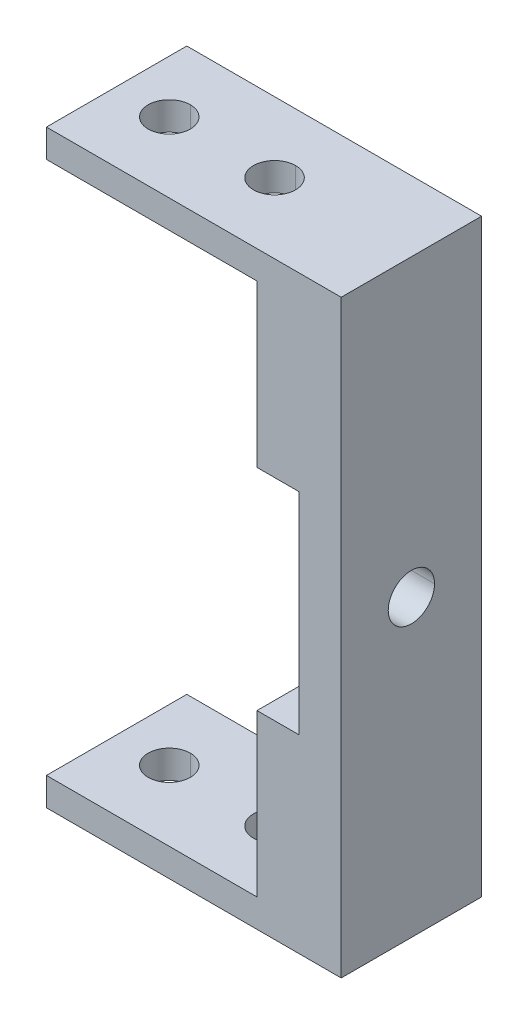
ISO-10303-21;
HEADER;
FILE_DESCRIPTION(('STEP AP214'),'2;1');
FILE_NAME('part.step','',(''),(''),'','','');
FILE_SCHEMA(('AUTOMOTIVE_DESIGN { 1 0 10303 214 1 1 1 1 }'));
ENDSEC;
DATA;
#1=APPLICATION_CONTEXT('core data for automotive mechanical design processes');
#2=APPLICATION_PROTOCOL_DEFINITION('international standard','automotive_design',2000,#1);
#3=PRODUCT_CONTEXT('',#1,'mechanical');
#4=PRODUCT('Part','Part','',(#3));
#5=PRODUCT_RELATED_PRODUCT_CATEGORY('part','',(#4));
#6=PRODUCT_DEFINITION_FORMATION('','',#4);
#7=PRODUCT_DEFINITION_CONTEXT('part definition',#1,'design');
#8=PRODUCT_DEFINITION('design','',#6,#7);
#9=PRODUCT_DEFINITION_SHAPE('','',#8);
#10=(LENGTH_UNIT() NAMED_UNIT(*) SI_UNIT(.MILLI.,.METRE.));
#11=(NAMED_UNIT(*) PLANE_ANGLE_UNIT() SI_UNIT($,.RADIAN.));
#12=(NAMED_UNIT(*) SI_UNIT($,.STERADIAN.) SOLID_ANGLE_UNIT());
#13=UNCERTAINTY_MEASURE_WITH_UNIT(LENGTH_MEASURE(1.E-05),#10,'distance_accuracy_value','');
#14=(GEOMETRIC_REPRESENTATION_CONTEXT(3) GLOBAL_UNCERTAINTY_ASSIGNED_CONTEXT((#13)) GLOBAL_UNIT_ASSIGNED_CONTEXT((#10,
#11,#12)) REPRESENTATION_CONTEXT('',''));
#15=CARTESIAN_POINT('',(0.,0.,0.));
#16=DIRECTION('',(0.,0.,1.));
#17=DIRECTION('',(1.,0.,0.));
#18=AXIS2_PLACEMENT_3D('',#15,#16,#17);
#19=CARTESIAN_POINT('',(0.,0.,0.));
#20=DIRECTION('',(1.,0.,0.));
#21=DIRECTION('',(0.,0.,-1.));
#22=AXIS2_PLACEMENT_3D('',#19,#20,#21);
#23=CYLINDRICAL_SURFACE('',#22,1.65);
#24=DIRECTION('',(1.,0.,0.));
#25=VECTOR('',#24,1.);
#26=CARTESIAN_POINT('',(0.,0.,1.65));
#27=LINE('',#26,#25);
#28=CARTESIAN_POINT('',(-3.,0.,1.65));
#29=VERTEX_POINT('',#28);
#30=CARTESIAN_POINT('',(0.,0.,1.65));
#31=VERTEX_POINT('',#30);
#32=EDGE_CURVE('E276',#29,#31,#27,.T.);
#33=ORIENTED_EDGE('',*,*,#32,.F.);
#34=CARTESIAN_POINT('',(-3.,0.,0.));
#35=DIRECTION('',(1.,0.,0.));
#36=DIRECTION('',(0.,1.,0.));
#37=AXIS2_PLACEMENT_3D('',#34,#35,#36);
#38=CIRCLE('',#37,1.65);
#39=CARTESIAN_POINT('',(-3.,0.,-1.65));
#40=VERTEX_POINT('',#39);
#41=EDGE_CURVE('E296',#40,#29,#38,.T.);
#42=ORIENTED_EDGE('',*,*,#41,.F.);
#43=DIRECTION('',(1.,0.,0.));
#44=VECTOR('',#43,1.);
#45=CARTESIAN_POINT('',(0.,0.,-1.65));
#46=LINE('',#45,#44);
#47=CARTESIAN_POINT('',(0.,0.,-1.65));
#48=VERTEX_POINT('',#47);
#49=EDGE_CURVE('E281',#40,#48,#46,.T.);
#50=ORIENTED_EDGE('',*,*,#49,.T.);
#51=CARTESIAN_POINT('',(0.,0.,0.));
#52=DIRECTION('',(1.,0.,0.));
#53=DIRECTION('',(0.,0.,-1.));
#54=AXIS2_PLACEMENT_3D('',#51,#52,#53);
#55=CIRCLE('',#54,1.65);
#56=EDGE_CURVE('E256',#48,#31,#55,.T.);
#57=ORIENTED_EDGE('',*,*,#56,.T.);
#58=EDGE_LOOP('',(#33,#42,#50,#57));
#59=FACE_BOUND('',#58,.T.);
#60=ADVANCED_FACE('F16',(#59),#23,.F.);
#61=CARTESIAN_POINT('',(-9.75,-21.,0.));
#62=DIRECTION('',(0.,1.,0.));
#63=DIRECTION('',(0.,0.,1.));
#64=AXIS2_PLACEMENT_3D('',#61,#62,#63);
#65=CYLINDRICAL_SURFACE('',#64,1.5);
#66=DIRECTION('',(0.,1.,0.));
#67=VECTOR('',#66,1.);
#68=CARTESIAN_POINT('',(-9.75,-21.,-1.5));
#69=LINE('',#68,#67);
#70=CARTESIAN_POINT('',(-9.75,19.,-1.5));
#71=VERTEX_POINT('',#70);
#72=CARTESIAN_POINT('',(-9.75,21.,-1.5));
#73=VERTEX_POINT('',#72);
#74=EDGE_CURVE('E291',#71,#73,#69,.T.);
#75=ORIENTED_EDGE('',*,*,#74,.F.);
#76=CARTESIAN_POINT('',(-9.75,19.,0.));
#77=DIRECTION('',(0.,1.,0.));
#78=DIRECTION('',(0.,0.,1.));
#79=AXIS2_PLACEMENT_3D('',#76,#77,#78);
#80=CIRCLE('',#79,1.5);
#81=CARTESIAN_POINT('',(-9.75,19.,1.5));
#82=VERTEX_POINT('',#81);
#83=EDGE_CURVE('E312',#82,#71,#80,.T.);
#84=ORIENTED_EDGE('',*,*,#83,.F.);
#85=DIRECTION('',(0.,1.,0.));
#86=VECTOR('',#85,1.);
#87=CARTESIAN_POINT('',(-9.75,-21.,1.5));
#88=LINE('',#87,#86);
#89=CARTESIAN_POINT('',(-9.75,21.,1.5));
#90=VERTEX_POINT('',#89);
#91=EDGE_CURVE('E290',#82,#90,#88,.T.);
#92=ORIENTED_EDGE('',*,*,#91,.T.);
#93=CARTESIAN_POINT('',(-9.75,21.,0.));
#94=DIRECTION('',(0.,1.,0.));
#95=DIRECTION('',(0.,0.,-1.));
#96=AXIS2_PLACEMENT_3D('',#93,#94,#95);
#97=CIRCLE('',#96,1.5);
#98=EDGE_CURVE('E349',#90,#73,#97,.T.);
#99=ORIENTED_EDGE('',*,*,#98,.T.);
#100=EDGE_LOOP('',(#75,#84,#92,#99));
#101=FACE_BOUND('',#100,.T.);
#102=ADVANCED_FACE('F671',(#101),#65,.F.);
#103=CARTESIAN_POINT('',(-9.75,-21.,0.));
#104=DIRECTION('',(0.,1.,0.));
#105=DIRECTION('',(0.,0.,1.));
#106=AXIS2_PLACEMENT_3D('',#103,#104,#105);
#107=CYLINDRICAL_SURFACE('',#106,1.5);
#108=DIRECTION('',(0.,1.,0.));
#109=VECTOR('',#108,1.);
#110=CARTESIAN_POINT('',(-9.75,-21.,-1.5));
#111=LINE('',#110,#109);
#112=CARTESIAN_POINT('',(-9.75,-21.,-1.5));
#113=VERTEX_POINT('',#112);
#114=CARTESIAN_POINT('',(-9.75,-19.,-1.5));
#115=VERTEX_POINT('',#114);
#116=EDGE_CURVE('E339',#113,#115,#111,.T.);
#117=ORIENTED_EDGE('',*,*,#116,.F.);
#118=CARTESIAN_POINT('',(-9.75,-21.,0.));
#119=DIRECTION('',(0.,1.,0.));
#120=DIRECTION('',(0.,0.,-1.));
#121=AXIS2_PLACEMENT_3D('',#118,#119,#120);
#122=CIRCLE('',#121,1.5);
#123=CARTESIAN_POINT('',(-9.75,-21.,1.5));
#124=VERTEX_POINT('',#123);
#125=EDGE_CURVE('E26',#124,#113,#122,.T.);
#126=ORIENTED_EDGE('',*,*,#125,.F.);
#127=DIRECTION('',(0.,1.,0.));
#128=VECTOR('',#127,1.);
#129=CARTESIAN_POINT('',(-9.75,-21.,1.5));
#130=LINE('',#129,#128);
#131=CARTESIAN_POINT('',(-9.75,-19.,1.5));
#132=VERTEX_POINT('',#131);
#133=EDGE_CURVE('E338',#124,#132,#130,.T.);
#134=ORIENTED_EDGE('',*,*,#133,.T.);
#135=CARTESIAN_POINT('',(-9.75,-19.,0.));
#136=DIRECTION('',(0.,-1.,0.));
#137=DIRECTION('',(1.,0.,0.));
#138=AXIS2_PLACEMENT_3D('',#135,#136,#137);
#139=CIRCLE('',#138,1.5);
#140=EDGE_CURVE('E147',#115,#132,#139,.T.);
#141=ORIENTED_EDGE('',*,*,#140,.F.);
#142=EDGE_LOOP('',(#117,#126,#134,#141));
#143=FACE_BOUND('',#142,.T.);
#144=ADVANCED_FACE('F496',(#143),#107,.F.);
#145=CARTESIAN_POINT('',(-17.25,-21.,0.));
#146=DIRECTION('',(0.,1.,0.));
#147=DIRECTION('',(0.,0.,1.));
#148=AXIS2_PLACEMENT_3D('',#145,#146,#147);
#149=CYLINDRICAL_SURFACE('',#148,1.5);
#150=DIRECTION('',(0.,1.,0.));
#151=VECTOR('',#150,1.);
#152=CARTESIAN_POINT('',(-17.25,-21.,-1.5));
#153=LINE('',#152,#151);
#154=CARTESIAN_POINT('',(-17.25,19.,-1.5));
#155=VERTEX_POINT('',#154);
#156=CARTESIAN_POINT('',(-17.25,21.,-1.5));
#157=VERTEX_POINT('',#156);
#158=EDGE_CURVE('E381',#155,#157,#153,.T.);
#159=ORIENTED_EDGE('',*,*,#158,.F.);
#160=CARTESIAN_POINT('',(-17.25,19.,0.));
#161=DIRECTION('',(0.,1.,0.));
#162=DIRECTION('',(0.,0.,1.));
#163=AXIS2_PLACEMENT_3D('',#160,#161,#162);
#164=CIRCLE('',#163,1.5);
#165=CARTESIAN_POINT('',(-17.25,19.,1.5));
#166=VERTEX_POINT('',#165);
#167=EDGE_CURVE('E308',#166,#155,#164,.T.);
#168=ORIENTED_EDGE('',*,*,#167,.F.);
#169=DIRECTION('',(0.,1.,0.));
#170=VECTOR('',#169,1.);
#171=CARTESIAN_POINT('',(-17.25,-21.,1.5));
#172=LINE('',#171,#170);
#173=CARTESIAN_POINT('',(-17.25,21.,1.5));
#174=VERTEX_POINT('',#173);
#175=EDGE_CURVE('E231',#166,#174,#172,.T.);
#176=ORIENTED_EDGE('',*,*,#175,.T.);
#177=CARTESIAN_POINT('',(-17.25,21.,0.));
#178=DIRECTION('',(0.,1.,0.));
#179=DIRECTION('',(0.,0.,1.));
#180=AXIS2_PLACEMENT_3D('',#177,#178,#179);
#181=CIRCLE('',#180,1.5);
#182=EDGE_CURVE('E346',#174,#157,#181,.T.);
#183=ORIENTED_EDGE('',*,*,#182,.T.);
#184=EDGE_LOOP('',(#159,#168,#176,#183));
#185=FACE_BOUND('',#184,.T.);
#186=ADVANCED_FACE('F741',(#185),#149,.F.);
#187=CARTESIAN_POINT('',(-17.25,-21.,0.));
#188=DIRECTION('',(0.,1.,0.));
#189=DIRECTION('',(0.,0.,1.));
#190=AXIS2_PLACEMENT_3D('',#187,#188,#189);
#191=CYLINDRICAL_SURFACE('',#190,1.5);
#192=DIRECTION('',(0.,1.,0.));
#193=VECTOR('',#192,1.);
#194=CARTESIAN_POINT('',(-17.25,-21.,-1.5));
#195=LINE('',#194,#193);
#196=CARTESIAN_POINT('',(-17.25,-21.,-1.5));
#197=VERTEX_POINT('',#196);
#198=CARTESIAN_POINT('',(-17.25,-19.,-1.5));
#199=VERTEX_POINT('',#198);
#200=EDGE_CURVE('E208',#197,#199,#195,.T.);
#201=ORIENTED_EDGE('',*,*,#200,.F.);
#202=CARTESIAN_POINT('',(-17.25,-21.,0.));
#203=DIRECTION('',(0.,1.,0.));
#204=DIRECTION('',(0.,0.,1.));
#205=AXIS2_PLACEMENT_3D('',#202,#203,#204);
#206=CIRCLE('',#205,1.5);
#207=CARTESIAN_POINT('',(-17.25,-21.,1.5));
#208=VERTEX_POINT('',#207);
#209=EDGE_CURVE('E10',#208,#197,#206,.T.);
#210=ORIENTED_EDGE('',*,*,#209,.F.);
#211=DIRECTION('',(0.,1.,0.));
#212=VECTOR('',#211,1.);
#213=CARTESIAN_POINT('',(-17.25,-21.,1.5));
#214=LINE('',#213,#212);
#215=CARTESIAN_POINT('',(-17.25,-19.,1.5));
#216=VERTEX_POINT('',#215);
#217=EDGE_CURVE('E211',#208,#216,#214,.T.);
#218=ORIENTED_EDGE('',*,*,#217,.T.);
#219=CARTESIAN_POINT('',(-17.25,-19.,0.));
#220=DIRECTION('',(0.,-1.,0.));
#221=DIRECTION('',(1.,0.,0.));
#222=AXIS2_PLACEMENT_3D('',#219,#220,#221);
#223=CIRCLE('',#222,1.5);
#224=EDGE_CURVE('E204',#199,#216,#223,.T.);
#225=ORIENTED_EDGE('',*,*,#224,.F.);
#226=EDGE_LOOP('',(#201,#210,#218,#225));
#227=FACE_BOUND('',#226,.T.);
#228=ADVANCED_FACE('F206',(#227),#191,.F.);
#229=CARTESIAN_POINT('',(0.,0.,-5.));
#230=DIRECTION('',(0.,0.,-1.));
#231=DIRECTION('',(0.,-1.,0.));
#232=AXIS2_PLACEMENT_3D('',#229,#230,#231);
#233=PLANE('',#232);
#234=DIRECTION('',(0.,1.,0.));
#235=VECTOR('',#234,1.);
#236=CARTESIAN_POINT('',(0.,21.,-5.));
#237=LINE('',#236,#235);
#238=CARTESIAN_POINT('',(0.,-21.,-5.));
#239=VERTEX_POINT('',#238);
#240=CARTESIAN_POINT('',(0.,21.,-5.));
#241=VERTEX_POINT('',#240);
#242=EDGE_CURVE('E262',#239,#241,#237,.T.);
#243=ORIENTED_EDGE('',*,*,#242,.F.);
#244=DIRECTION('',(1.,0.,0.));
#245=VECTOR('',#244,1.);
#246=CARTESIAN_POINT('',(0.,-21.,-5.));
#247=LINE('',#246,#245);
#248=CARTESIAN_POINT('',(-21.,-21.,-5.));
#249=VERTEX_POINT('',#248);
#250=EDGE_CURVE('E53',#249,#239,#247,.T.);
#251=ORIENTED_EDGE('',*,*,#250,.F.);
#252=DIRECTION('',(0.,-1.,0.));
#253=VECTOR('',#252,1.);
#254=CARTESIAN_POINT('',(-21.,-21.,-5.));
#255=LINE('',#254,#253);
#256=CARTESIAN_POINT('',(-21.,-19.,-5.));
#257=VERTEX_POINT('',#256);
#258=EDGE_CURVE('E215',#257,#249,#255,.T.);
#259=ORIENTED_EDGE('',*,*,#258,.F.);
#260=DIRECTION('',(-1.,0.,0.));
#261=VECTOR('',#260,1.);
#262=CARTESIAN_POINT('',(-21.,-19.,-5.));
#263=LINE('',#262,#261);
#264=CARTESIAN_POINT('',(-6.,-19.,-5.));
#265=VERTEX_POINT('',#264);
#266=EDGE_CURVE('E272',#265,#257,#263,.T.);
#267=ORIENTED_EDGE('',*,*,#266,.F.);
#268=DIRECTION('',(0.,-1.,0.));
#269=VECTOR('',#268,1.);
#270=CARTESIAN_POINT('',(-6.,-19.,-5.));
#271=LINE('',#270,#269);
#272=CARTESIAN_POINT('',(-6.,-7.5,-5.));
#273=VERTEX_POINT('',#272);
#274=EDGE_CURVE('E250',#273,#265,#271,.T.);
#275=ORIENTED_EDGE('',*,*,#274,.F.);
#276=DIRECTION('',(-1.,0.,0.));
#277=VECTOR('',#276,1.);
#278=CARTESIAN_POINT('',(-6.,-7.5,-5.));
#279=LINE('',#278,#277);
#280=CARTESIAN_POINT('',(-3.,-7.5,-5.));
#281=VERTEX_POINT('',#280);
#282=EDGE_CURVE('E313',#281,#273,#279,.T.);
#283=ORIENTED_EDGE('',*,*,#282,.F.);
#284=DIRECTION('',(0.,-1.,0.));
#285=VECTOR('',#284,1.);
#286=CARTESIAN_POINT('',(-3.,7.5,-5.));
#287=LINE('',#286,#285);
#288=CARTESIAN_POINT('',(-3.,7.5,-5.));
#289=VERTEX_POINT('',#288);
#290=EDGE_CURVE('E267',#289,#281,#287,.T.);
#291=ORIENTED_EDGE('',*,*,#290,.F.);
#292=DIRECTION('',(1.,0.,0.));
#293=VECTOR('',#292,1.);
#294=CARTESIAN_POINT('',(-6.,7.5,-5.));
#295=LINE('',#294,#293);
#296=CARTESIAN_POINT('',(-6.,7.5,-5.));
#297=VERTEX_POINT('',#296);
#298=EDGE_CURVE('E237',#297,#289,#295,.T.);
#299=ORIENTED_EDGE('',*,*,#298,.F.);
#300=DIRECTION('',(0.,-1.,0.));
#301=VECTOR('',#300,1.);
#302=CARTESIAN_POINT('',(-6.,19.,-5.));
#303=LINE('',#302,#301);
#304=CARTESIAN_POINT('',(-6.,19.,-5.));
#305=VERTEX_POINT('',#304);
#306=EDGE_CURVE('E311',#305,#297,#303,.T.);
#307=ORIENTED_EDGE('',*,*,#306,.F.);
#308=DIRECTION('',(1.,0.,0.));
#309=VECTOR('',#308,1.);
#310=CARTESIAN_POINT('',(-21.,19.,-5.));
#311=LINE('',#310,#309);
#312=CARTESIAN_POINT('',(-21.,19.,-5.));
#313=VERTEX_POINT('',#312);
#314=EDGE_CURVE('E389',#313,#305,#311,.T.);
#315=ORIENTED_EDGE('',*,*,#314,.F.);
#316=DIRECTION('',(0.,-1.,0.));
#317=VECTOR('',#316,1.);
#318=CARTESIAN_POINT('',(-21.,21.,-5.));
#319=LINE('',#318,#317);
#320=CARTESIAN_POINT('',(-21.,21.,-5.));
#321=VERTEX_POINT('',#320);
#322=EDGE_CURVE('E307',#321,#313,#319,.T.);
#323=ORIENTED_EDGE('',*,*,#322,.F.);
#324=DIRECTION('',(-1.,0.,0.));
#325=VECTOR('',#324,1.);
#326=CARTESIAN_POINT('',(0.,21.,-5.));
#327=LINE('',#326,#325);
#328=EDGE_CURVE('E396',#241,#321,#327,.T.);
#329=ORIENTED_EDGE('',*,*,#328,.F.);
#330=EDGE_LOOP('',(#243,#251,#259,#267,#275,#283,#291,#299,#307,#315,#323,#329));
#331=FACE_BOUND('',#330,.T.);
#332=ADVANCED_FACE('F453',(#331),#233,.T.);
#333=CARTESIAN_POINT('',(0.,0.,5.));
#334=DIRECTION('',(0.,0.,-1.));
#335=DIRECTION('',(0.,-1.,0.));
#336=AXIS2_PLACEMENT_3D('',#333,#334,#335);
#337=PLANE('',#336);
#338=DIRECTION('',(0.,1.,0.));
#339=VECTOR('',#338,1.);
#340=CARTESIAN_POINT('',(0.,21.,5.));
#341=LINE('',#340,#339);
#342=CARTESIAN_POINT('',(0.,-21.,5.));
#343=VERTEX_POINT('',#342);
#344=CARTESIAN_POINT('',(0.,21.,5.));
#345=VERTEX_POINT('',#344);
#346=EDGE_CURVE('E257',#343,#345,#341,.T.);
#347=ORIENTED_EDGE('',*,*,#346,.T.);
#348=DIRECTION('',(-1.,0.,0.));
#349=VECTOR('',#348,1.);
#350=CARTESIAN_POINT('',(0.,21.,5.));
#351=LINE('',#350,#349);
#352=CARTESIAN_POINT('',(-21.,21.,5.));
#353=VERTEX_POINT('',#352);
#354=EDGE_CURVE('E405',#345,#353,#351,.T.);
#355=ORIENTED_EDGE('',*,*,#354,.T.);
#356=DIRECTION('',(0.,-1.,0.));
#357=VECTOR('',#356,1.);
#358=CARTESIAN_POINT('',(-21.,21.,5.));
#359=LINE('',#358,#357);
#360=CARTESIAN_POINT('',(-21.,19.,5.));
#361=VERTEX_POINT('',#360);
#362=EDGE_CURVE('E306',#353,#361,#359,.T.);
#363=ORIENTED_EDGE('',*,*,#362,.T.);
#364=DIRECTION('',(1.,0.,0.));
#365=VECTOR('',#364,1.);
#366=CARTESIAN_POINT('',(-21.,19.,5.));
#367=LINE('',#366,#365);
#368=CARTESIAN_POINT('',(-6.,19.,5.));
#369=VERTEX_POINT('',#368);
#370=EDGE_CURVE('E368',#361,#369,#367,.T.);
#371=ORIENTED_EDGE('',*,*,#370,.T.);
#372=DIRECTION('',(0.,-1.,0.));
#373=VECTOR('',#372,1.);
#374=CARTESIAN_POINT('',(-6.,19.,5.));
#375=LINE('',#374,#373);
#376=CARTESIAN_POINT('',(-6.,7.5,5.));
#377=VERTEX_POINT('',#376);
#378=EDGE_CURVE('E242',#369,#377,#375,.T.);
#379=ORIENTED_EDGE('',*,*,#378,.T.);
#380=DIRECTION('',(1.,0.,0.));
#381=VECTOR('',#380,1.);
#382=CARTESIAN_POINT('',(-6.,7.5,5.));
#383=LINE('',#382,#381);
#384=CARTESIAN_POINT('',(-3.,7.5,5.));
#385=VERTEX_POINT('',#384);
#386=EDGE_CURVE('E263',#377,#385,#383,.T.);
#387=ORIENTED_EDGE('',*,*,#386,.T.);
#388=DIRECTION('',(0.,-1.,0.));
#389=VECTOR('',#388,1.);
#390=CARTESIAN_POINT('',(-3.,7.5,5.));
#391=LINE('',#390,#389);
#392=CARTESIAN_POINT('',(-3.,-7.5,5.));
#393=VERTEX_POINT('',#392);
#394=EDGE_CURVE('E292',#385,#393,#391,.T.);
#395=ORIENTED_EDGE('',*,*,#394,.T.);
#396=DIRECTION('',(-1.,0.,0.));
#397=VECTOR('',#396,1.);
#398=CARTESIAN_POINT('',(-6.,-7.5,5.));
#399=LINE('',#398,#397);
#400=CARTESIAN_POINT('',(-6.,-7.5,5.));
#401=VERTEX_POINT('',#400);
#402=EDGE_CURVE('E246',#393,#401,#399,.T.);
#403=ORIENTED_EDGE('',*,*,#402,.T.);
#404=DIRECTION('',(0.,-1.,0.));
#405=VECTOR('',#404,1.);
#406=CARTESIAN_POINT('',(-6.,-19.,5.));
#407=LINE('',#406,#405);
#408=CARTESIAN_POINT('',(-6.,-19.,5.));
#409=VERTEX_POINT('',#408);
#410=EDGE_CURVE('E268',#401,#409,#407,.T.);
#411=ORIENTED_EDGE('',*,*,#410,.T.);
#412=DIRECTION('',(-1.,0.,0.));
#413=VECTOR('',#412,1.);
#414=CARTESIAN_POINT('',(-21.,-19.,5.));
#415=LINE('',#414,#413);
#416=CARTESIAN_POINT('',(-21.,-19.,5.));
#417=VERTEX_POINT('',#416);
#418=EDGE_CURVE('E382',#409,#417,#415,.T.);
#419=ORIENTED_EDGE('',*,*,#418,.T.);
#420=DIRECTION('',(0.,-1.,0.));
#421=VECTOR('',#420,1.);
#422=CARTESIAN_POINT('',(-21.,-21.,5.));
#423=LINE('',#422,#421);
#424=CARTESIAN_POINT('',(-21.,-21.,5.));
#425=VERTEX_POINT('',#424);
#426=EDGE_CURVE('E245',#417,#425,#423,.T.);
#427=ORIENTED_EDGE('',*,*,#426,.T.);
#428=DIRECTION('',(1.,0.,0.));
#429=VECTOR('',#428,1.);
#430=CARTESIAN_POINT('',(0.,-21.,5.));
#431=LINE('',#430,#429);
#432=EDGE_CURVE('E39',#425,#343,#431,.T.);
#433=ORIENTED_EDGE('',*,*,#432,.T.);
#434=EDGE_LOOP('',(#347,#355,#363,#371,#379,#387,#395,#403,#411,#419,#427,#433));
#435=FACE_BOUND('',#434,.T.);
#436=ADVANCED_FACE('F523',(#435),#337,.F.);
#437=CARTESIAN_POINT('',(0.,-21.,5.));
#438=DIRECTION('',(0.,1.,0.));
#439=DIRECTION('',(1.,0.,0.));
#440=AXIS2_PLACEMENT_3D('',#437,#438,#439);
#441=PLANE('',#440);
#442=ORIENTED_EDGE('',*,*,#209,.T.);
#443=CARTESIAN_POINT('',(-17.25,-21.,0.));
#444=DIRECTION('',(0.,1.,0.));
#445=DIRECTION('',(0.,0.,1.));
#446=AXIS2_PLACEMENT_3D('',#443,#444,#445);
#447=CIRCLE('',#446,1.5);
#448=EDGE_CURVE('E224',#197,#208,#447,.T.);
#449=ORIENTED_EDGE('',*,*,#448,.T.);
#450=EDGE_LOOP('',(#442,#449));
#451=FACE_BOUND('',#450,.T.);
#452=ORIENTED_EDGE('',*,*,#125,.T.);
#453=CARTESIAN_POINT('',(-9.75,-21.,0.));
#454=DIRECTION('',(0.,1.,0.));
#455=DIRECTION('',(0.,0.,-1.));
#456=AXIS2_PLACEMENT_3D('',#453,#454,#455);
#457=CIRCLE('',#456,1.5);
#458=EDGE_CURVE('E352',#113,#124,#457,.T.);
#459=ORIENTED_EDGE('',*,*,#458,.T.);
#460=EDGE_LOOP('',(#452,#459));
#461=FACE_BOUND('',#460,.T.);
#462=ORIENTED_EDGE('',*,*,#250,.T.);
#463=DIRECTION('',(0.,0.,-1.));
#464=VECTOR('',#463,1.);
#465=CARTESIAN_POINT('',(0.,-21.,5.));
#466=LINE('',#465,#464);
#467=EDGE_CURVE('E252',#343,#239,#466,.T.);
#468=ORIENTED_EDGE('',*,*,#467,.F.);
#469=ORIENTED_EDGE('',*,*,#432,.F.);
#470=DIRECTION('',(0.,0.,-1.));
#471=VECTOR('',#470,1.);
#472=CARTESIAN_POINT('',(-21.,-21.,5.));
#473=LINE('',#472,#471);
#474=EDGE_CURVE('E275',#425,#249,#473,.T.);
#475=ORIENTED_EDGE('',*,*,#474,.T.);
#476=EDGE_LOOP('',(#462,#468,#469,#475));
#477=FACE_BOUND('',#476,.T.);
#478=ADVANCED_FACE('F493',(#451,#461,#477),#441,.F.);
#479=CARTESIAN_POINT('',(-21.,-21.,5.));
#480=DIRECTION('',(1.,0.,0.));
#481=DIRECTION('',(0.,1.,0.));
#482=AXIS2_PLACEMENT_3D('',#479,#480,#481);
#483=PLANE('',#482);
#484=ORIENTED_EDGE('',*,*,#258,.T.);
#485=ORIENTED_EDGE('',*,*,#474,.F.);
#486=ORIENTED_EDGE('',*,*,#426,.F.);
#487=DIRECTION('',(0.,0.,-1.));
#488=VECTOR('',#487,1.);
#489=CARTESIAN_POINT('',(-21.,-19.,5.));
#490=LINE('',#489,#488);
#491=EDGE_CURVE('E372',#417,#257,#490,.T.);
#492=ORIENTED_EDGE('',*,*,#491,.T.);
#493=EDGE_LOOP('',(#484,#485,#486,#492));
#494=FACE_BOUND('',#493,.T.);
#495=ADVANCED_FACE('F505',(#494),#483,.F.);
#496=CARTESIAN_POINT('',(-21.,-19.,5.));
#497=DIRECTION('',(0.,-1.,0.));
#498=DIRECTION('',(0.,0.,-1.));
#499=AXIS2_PLACEMENT_3D('',#496,#497,#498);
#500=PLANE('',#499);
#501=CARTESIAN_POINT('',(-17.25,-19.,0.));
#502=DIRECTION('',(0.,-1.,0.));
#503=DIRECTION('',(1.,0.,0.));
#504=AXIS2_PLACEMENT_3D('',#501,#502,#503);
#505=CIRCLE('',#504,1.5);
#506=EDGE_CURVE('E217',#216,#199,#505,.T.);
#507=ORIENTED_EDGE('',*,*,#506,.T.);
#508=ORIENTED_EDGE('',*,*,#224,.T.);
#509=EDGE_LOOP('',(#507,#508));
#510=FACE_BOUND('',#509,.T.);
#511=CARTESIAN_POINT('',(-9.75,-19.,0.));
#512=DIRECTION('',(0.,-1.,0.));
#513=DIRECTION('',(1.,0.,0.));
#514=AXIS2_PLACEMENT_3D('',#511,#512,#513);
#515=CIRCLE('',#514,1.5);
#516=EDGE_CURVE('E335',#132,#115,#515,.T.);
#517=ORIENTED_EDGE('',*,*,#516,.T.);
#518=ORIENTED_EDGE('',*,*,#140,.T.);
#519=EDGE_LOOP('',(#517,#518));
#520=FACE_BOUND('',#519,.T.);
#521=ORIENTED_EDGE('',*,*,#266,.T.);
#522=ORIENTED_EDGE('',*,*,#491,.F.);
#523=ORIENTED_EDGE('',*,*,#418,.F.);
#524=DIRECTION('',(0.,0.,-1.));
#525=VECTOR('',#524,1.);
#526=CARTESIAN_POINT('',(-6.,-19.,5.));
#527=LINE('',#526,#525);
#528=EDGE_CURVE('E20',#409,#265,#527,.T.);
#529=ORIENTED_EDGE('',*,*,#528,.T.);
#530=EDGE_LOOP('',(#521,#522,#523,#529));
#531=FACE_BOUND('',#530,.T.);
#532=ADVANCED_FACE('F18',(#510,#520,#531),#500,.F.);
#533=CARTESIAN_POINT('',(-6.,-19.,5.));
#534=DIRECTION('',(1.,0.,0.));
#535=DIRECTION('',(0.,1.,0.));
#536=AXIS2_PLACEMENT_3D('',#533,#534,#535);
#537=PLANE('',#536);
#538=ORIENTED_EDGE('',*,*,#274,.T.);
#539=ORIENTED_EDGE('',*,*,#528,.F.);
#540=ORIENTED_EDGE('',*,*,#410,.F.);
#541=DIRECTION('',(0.,0.,-1.));
#542=VECTOR('',#541,1.);
#543=CARTESIAN_POINT('',(-6.,-7.5,5.));
#544=LINE('',#543,#542);
#545=EDGE_CURVE('E251',#401,#273,#544,.T.);
#546=ORIENTED_EDGE('',*,*,#545,.T.);
#547=EDGE_LOOP('',(#538,#539,#540,#546));
#548=FACE_BOUND('',#547,.T.);
#549=ADVANCED_FACE('F504',(#548),#537,.F.);
#550=CARTESIAN_POINT('',(-6.,-7.5,5.));
#551=DIRECTION('',(0.,-1.,0.));
#552=DIRECTION('',(0.,0.,-1.));
#553=AXIS2_PLACEMENT_3D('',#550,#551,#552);
#554=PLANE('',#553);
#555=ORIENTED_EDGE('',*,*,#282,.T.);
#556=ORIENTED_EDGE('',*,*,#545,.F.);
#557=ORIENTED_EDGE('',*,*,#402,.F.);
#558=DIRECTION('',(0.,0.,-1.));
#559=VECTOR('',#558,1.);
#560=CARTESIAN_POINT('',(-3.,-7.5,5.));
#561=LINE('',#560,#559);
#562=EDGE_CURVE('E297',#393,#281,#561,.T.);
#563=ORIENTED_EDGE('',*,*,#562,.T.);
#564=EDGE_LOOP('',(#555,#556,#557,#563));
#565=FACE_BOUND('',#564,.T.);
#566=ADVANCED_FACE('F772',(#565),#554,.F.);
#567=CARTESIAN_POINT('',(-3.,7.5,5.));
#568=DIRECTION('',(1.,0.,0.));
#569=DIRECTION('',(0.,-1.,0.));
#570=AXIS2_PLACEMENT_3D('',#567,#568,#569);
#571=PLANE('',#570);
#572=ORIENTED_EDGE('',*,*,#41,.T.);
#573=CARTESIAN_POINT('',(-3.,0.,0.));
#574=DIRECTION('',(1.,0.,0.));
#575=DIRECTION('',(0.,1.,0.));
#576=AXIS2_PLACEMENT_3D('',#573,#574,#575);
#577=CIRCLE('',#576,1.65);
#578=EDGE_CURVE('E280',#29,#40,#577,.T.);
#579=ORIENTED_EDGE('',*,*,#578,.T.);
#580=EDGE_LOOP('',(#572,#579));
#581=FACE_BOUND('',#580,.T.);
#582=ORIENTED_EDGE('',*,*,#290,.T.);
#583=ORIENTED_EDGE('',*,*,#562,.F.);
#584=ORIENTED_EDGE('',*,*,#394,.F.);
#585=DIRECTION('',(0.,0.,-1.));
#586=VECTOR('',#585,1.);
#587=CARTESIAN_POINT('',(-3.,7.5,5.));
#588=LINE('',#587,#586);
#589=EDGE_CURVE('E241',#385,#289,#588,.T.);
#590=ORIENTED_EDGE('',*,*,#589,.T.);
#591=EDGE_LOOP('',(#582,#583,#584,#590));
#592=FACE_BOUND('',#591,.T.);
#593=ADVANCED_FACE('F418',(#581,#592),#571,.F.);
#594=CARTESIAN_POINT('',(-6.,7.5,5.));
#595=DIRECTION('',(0.,1.,0.));
#596=DIRECTION('',(1.,0.,0.));
#597=AXIS2_PLACEMENT_3D('',#594,#595,#596);
#598=PLANE('',#597);
#599=ORIENTED_EDGE('',*,*,#298,.T.);
#600=ORIENTED_EDGE('',*,*,#589,.F.);
#601=ORIENTED_EDGE('',*,*,#386,.F.);
#602=DIRECTION('',(0.,0.,-1.));
#603=VECTOR('',#602,1.);
#604=CARTESIAN_POINT('',(-6.,7.5,5.));
#605=LINE('',#604,#603);
#606=EDGE_CURVE('E331',#377,#297,#605,.T.);
#607=ORIENTED_EDGE('',*,*,#606,.T.);
#608=EDGE_LOOP('',(#599,#600,#601,#607));
#609=FACE_BOUND('',#608,.T.);
#610=ADVANCED_FACE('F697',(#609),#598,.F.);
#611=CARTESIAN_POINT('',(-6.,19.,5.));
#612=DIRECTION('',(1.,0.,0.));
#613=DIRECTION('',(0.,1.,0.));
#614=AXIS2_PLACEMENT_3D('',#611,#612,#613);
#615=PLANE('',#614);
#616=ORIENTED_EDGE('',*,*,#306,.T.);
#617=ORIENTED_EDGE('',*,*,#606,.F.);
#618=ORIENTED_EDGE('',*,*,#378,.F.);
#619=DIRECTION('',(0.,0.,-1.));
#620=VECTOR('',#619,1.);
#621=CARTESIAN_POINT('',(-6.,19.,5.));
#622=LINE('',#621,#620);
#623=EDGE_CURVE('E393',#369,#305,#622,.T.);
#624=ORIENTED_EDGE('',*,*,#623,.T.);
#625=EDGE_LOOP('',(#616,#617,#618,#624));
#626=FACE_BOUND('',#625,.T.);
#627=ADVANCED_FACE('F702',(#626),#615,.F.);
#628=CARTESIAN_POINT('',(-21.,19.,5.));
#629=DIRECTION('',(0.,1.,0.));
#630=DIRECTION('',(1.,0.,0.));
#631=AXIS2_PLACEMENT_3D('',#628,#629,#630);
#632=PLANE('',#631);
#633=ORIENTED_EDGE('',*,*,#167,.T.);
#634=CARTESIAN_POINT('',(-17.25,19.,0.));
#635=DIRECTION('',(0.,1.,0.));
#636=DIRECTION('',(0.,0.,1.));
#637=AXIS2_PLACEMENT_3D('',#634,#635,#636);
#638=CIRCLE('',#637,1.5);
#639=EDGE_CURVE('E342',#155,#166,#638,.T.);
#640=ORIENTED_EDGE('',*,*,#639,.T.);
#641=EDGE_LOOP('',(#633,#640));
#642=FACE_BOUND('',#641,.T.);
#643=ORIENTED_EDGE('',*,*,#83,.T.);
#644=CARTESIAN_POINT('',(-9.75,19.,0.));
#645=DIRECTION('',(0.,1.,0.));
#646=DIRECTION('',(0.,0.,1.));
#647=AXIS2_PLACEMENT_3D('',#644,#645,#646);
#648=CIRCLE('',#647,1.5);
#649=EDGE_CURVE('E285',#71,#82,#648,.T.);
#650=ORIENTED_EDGE('',*,*,#649,.T.);
#651=EDGE_LOOP('',(#643,#650));
#652=FACE_BOUND('',#651,.T.);
#653=ORIENTED_EDGE('',*,*,#314,.T.);
#654=ORIENTED_EDGE('',*,*,#623,.F.);
#655=ORIENTED_EDGE('',*,*,#370,.F.);
#656=DIRECTION('',(0.,0.,-1.));
#657=VECTOR('',#656,1.);
#658=CARTESIAN_POINT('',(-21.,19.,5.));
#659=LINE('',#658,#657);
#660=EDGE_CURVE('E302',#361,#313,#659,.T.);
#661=ORIENTED_EDGE('',*,*,#660,.T.);
#662=EDGE_LOOP('',(#653,#654,#655,#661));
#663=FACE_BOUND('',#662,.T.);
#664=ADVANCED_FACE('F460',(#642,#652,#663),#632,.F.);
#665=CARTESIAN_POINT('',(-21.,21.,5.));
#666=DIRECTION('',(1.,0.,0.));
#667=DIRECTION('',(0.,1.,0.));
#668=AXIS2_PLACEMENT_3D('',#665,#666,#667);
#669=PLANE('',#668);
#670=ORIENTED_EDGE('',*,*,#322,.T.);
#671=ORIENTED_EDGE('',*,*,#660,.F.);
#672=ORIENTED_EDGE('',*,*,#362,.F.);
#673=DIRECTION('',(0.,0.,-1.));
#674=VECTOR('',#673,1.);
#675=CARTESIAN_POINT('',(-21.,21.,5.));
#676=LINE('',#675,#674);
#677=EDGE_CURVE('E406',#353,#321,#676,.T.);
#678=ORIENTED_EDGE('',*,*,#677,.T.);
#679=EDGE_LOOP('',(#670,#671,#672,#678));
#680=FACE_BOUND('',#679,.T.);
#681=ADVANCED_FACE('F462',(#680),#669,.F.);
#682=CARTESIAN_POINT('',(0.,21.,5.));
#683=DIRECTION('',(0.,-1.,0.));
#684=DIRECTION('',(0.,0.,-1.));
#685=AXIS2_PLACEMENT_3D('',#682,#683,#684);
#686=PLANE('',#685);
#687=ORIENTED_EDGE('',*,*,#182,.F.);
#688=CARTESIAN_POINT('',(-17.25,21.,0.));
#689=DIRECTION('',(0.,1.,0.));
#690=DIRECTION('',(0.,0.,1.));
#691=AXIS2_PLACEMENT_3D('',#688,#689,#690);
#692=CIRCLE('',#691,1.5);
#693=EDGE_CURVE('E301',#157,#174,#692,.T.);
#694=ORIENTED_EDGE('',*,*,#693,.F.);
#695=EDGE_LOOP('',(#687,#694));
#696=FACE_BOUND('',#695,.T.);
#697=ORIENTED_EDGE('',*,*,#98,.F.);
#698=CARTESIAN_POINT('',(-9.75,21.,0.));
#699=DIRECTION('',(0.,1.,0.));
#700=DIRECTION('',(0.,0.,-1.));
#701=AXIS2_PLACEMENT_3D('',#698,#699,#700);
#702=CIRCLE('',#701,1.5);
#703=EDGE_CURVE('E286',#73,#90,#702,.T.);
#704=ORIENTED_EDGE('',*,*,#703,.F.);
#705=EDGE_LOOP('',(#697,#704));
#706=FACE_BOUND('',#705,.T.);
#707=ORIENTED_EDGE('',*,*,#328,.T.);
#708=ORIENTED_EDGE('',*,*,#677,.F.);
#709=ORIENTED_EDGE('',*,*,#354,.F.);
#710=DIRECTION('',(0.,0.,-1.));
#711=VECTOR('',#710,1.);
#712=CARTESIAN_POINT('',(0.,21.,5.));
#713=LINE('',#712,#711);
#714=EDGE_CURVE('E258',#345,#241,#713,.T.);
#715=ORIENTED_EDGE('',*,*,#714,.T.);
#716=EDGE_LOOP('',(#707,#708,#709,#715));
#717=FACE_BOUND('',#716,.T.);
#718=ADVANCED_FACE('F527',(#696,#706,#717),#686,.F.);
#719=CARTESIAN_POINT('',(0.,21.,5.));
#720=DIRECTION('',(-1.,0.,0.));
#721=DIRECTION('',(0.,1.,0.));
#722=AXIS2_PLACEMENT_3D('',#719,#720,#721);
#723=PLANE('',#722);
#724=ORIENTED_EDGE('',*,*,#56,.F.);
#725=CARTESIAN_POINT('',(0.,0.,0.));
#726=DIRECTION('',(1.,0.,0.));
#727=DIRECTION('',(0.,0.,-1.));
#728=AXIS2_PLACEMENT_3D('',#725,#726,#727);
#729=CIRCLE('',#728,1.65);
#730=EDGE_CURVE('E235',#31,#48,#729,.T.);
#731=ORIENTED_EDGE('',*,*,#730,.F.);
#732=EDGE_LOOP('',(#724,#731));
#733=FACE_BOUND('',#732,.T.);
#734=ORIENTED_EDGE('',*,*,#242,.T.);
#735=ORIENTED_EDGE('',*,*,#714,.F.);
#736=ORIENTED_EDGE('',*,*,#346,.F.);
#737=ORIENTED_EDGE('',*,*,#467,.T.);
#738=EDGE_LOOP('',(#734,#735,#736,#737));
#739=FACE_BOUND('',#738,.T.);
#740=ADVANCED_FACE('F529',(#733,#739),#723,.F.);
#741=CARTESIAN_POINT('',(-17.25,-21.,0.));
#742=DIRECTION('',(0.,1.,0.));
#743=DIRECTION('',(0.,0.,1.));
#744=AXIS2_PLACEMENT_3D('',#741,#742,#743);
#745=CYLINDRICAL_SURFACE('',#744,1.5);
#746=ORIENTED_EDGE('',*,*,#448,.F.);
#747=ORIENTED_EDGE('',*,*,#200,.T.);
#748=ORIENTED_EDGE('',*,*,#506,.F.);
#749=ORIENTED_EDGE('',*,*,#217,.F.);
#750=EDGE_LOOP('',(#746,#747,#748,#749));
#751=FACE_BOUND('',#750,.T.);
#752=ADVANCED_FACE('F222',(#751),#745,.F.);
#753=CARTESIAN_POINT('',(-17.25,-21.,0.));
#754=DIRECTION('',(0.,1.,0.));
#755=DIRECTION('',(0.,0.,1.));
#756=AXIS2_PLACEMENT_3D('',#753,#754,#755);
#757=CYLINDRICAL_SURFACE('',#756,1.5);
#758=ORIENTED_EDGE('',*,*,#639,.F.);
#759=ORIENTED_EDGE('',*,*,#158,.T.);
#760=ORIENTED_EDGE('',*,*,#693,.T.);
#761=ORIENTED_EDGE('',*,*,#175,.F.);
#762=EDGE_LOOP('',(#758,#759,#760,#761));
#763=FACE_BOUND('',#762,.T.);
#764=ADVANCED_FACE('F748',(#763),#757,.F.);
#765=CARTESIAN_POINT('',(-9.75,-21.,0.));
#766=DIRECTION('',(0.,1.,0.));
#767=DIRECTION('',(0.,0.,1.));
#768=AXIS2_PLACEMENT_3D('',#765,#766,#767);
#769=CYLINDRICAL_SURFACE('',#768,1.5);
#770=ORIENTED_EDGE('',*,*,#458,.F.);
#771=ORIENTED_EDGE('',*,*,#116,.T.);
#772=ORIENTED_EDGE('',*,*,#516,.F.);
#773=ORIENTED_EDGE('',*,*,#133,.F.);
#774=EDGE_LOOP('',(#770,#771,#772,#773));
#775=FACE_BOUND('',#774,.T.);
#776=ADVANCED_FACE('F501',(#775),#769,.F.);
#777=CARTESIAN_POINT('',(-9.75,-21.,0.));
#778=DIRECTION('',(0.,1.,0.));
#779=DIRECTION('',(0.,0.,1.));
#780=AXIS2_PLACEMENT_3D('',#777,#778,#779);
#781=CYLINDRICAL_SURFACE('',#780,1.5);
#782=ORIENTED_EDGE('',*,*,#649,.F.);
#783=ORIENTED_EDGE('',*,*,#74,.T.);
#784=ORIENTED_EDGE('',*,*,#703,.T.);
#785=ORIENTED_EDGE('',*,*,#91,.F.);
#786=EDGE_LOOP('',(#782,#783,#784,#785));
#787=FACE_BOUND('',#786,.T.);
#788=ADVANCED_FACE('F683',(#787),#781,.F.);
#789=CARTESIAN_POINT('',(0.,0.,0.));
#790=DIRECTION('',(1.,0.,0.));
#791=DIRECTION('',(0.,0.,-1.));
#792=AXIS2_PLACEMENT_3D('',#789,#790,#791);
#793=CYLINDRICAL_SURFACE('',#792,1.65);
#794=ORIENTED_EDGE('',*,*,#578,.F.);
#795=ORIENTED_EDGE('',*,*,#32,.T.);
#796=ORIENTED_EDGE('',*,*,#730,.T.);
#797=ORIENTED_EDGE('',*,*,#49,.F.);
#798=EDGE_LOOP('',(#794,#795,#796,#797));
#799=FACE_BOUND('',#798,.T.);
#800=ADVANCED_FACE('F426',(#799),#793,.F.);
#801=CLOSED_SHELL('',(#60,#102,#144,#186,#228,#332,#436,#478,#495,#532,#549,#566,#593,#610,#627,
#664,#681,#718,#740,#752,#764,#776,#788,#800));
#802=MANIFOLD_SOLID_BREP('B1',#801);
#803=ADVANCED_BREP_SHAPE_REPRESENTATION('',(#18,#802),#14);
#804=SHAPE_DEFINITION_REPRESENTATION(#9,#803);
ENDSEC;
END-ISO-10303-21;
